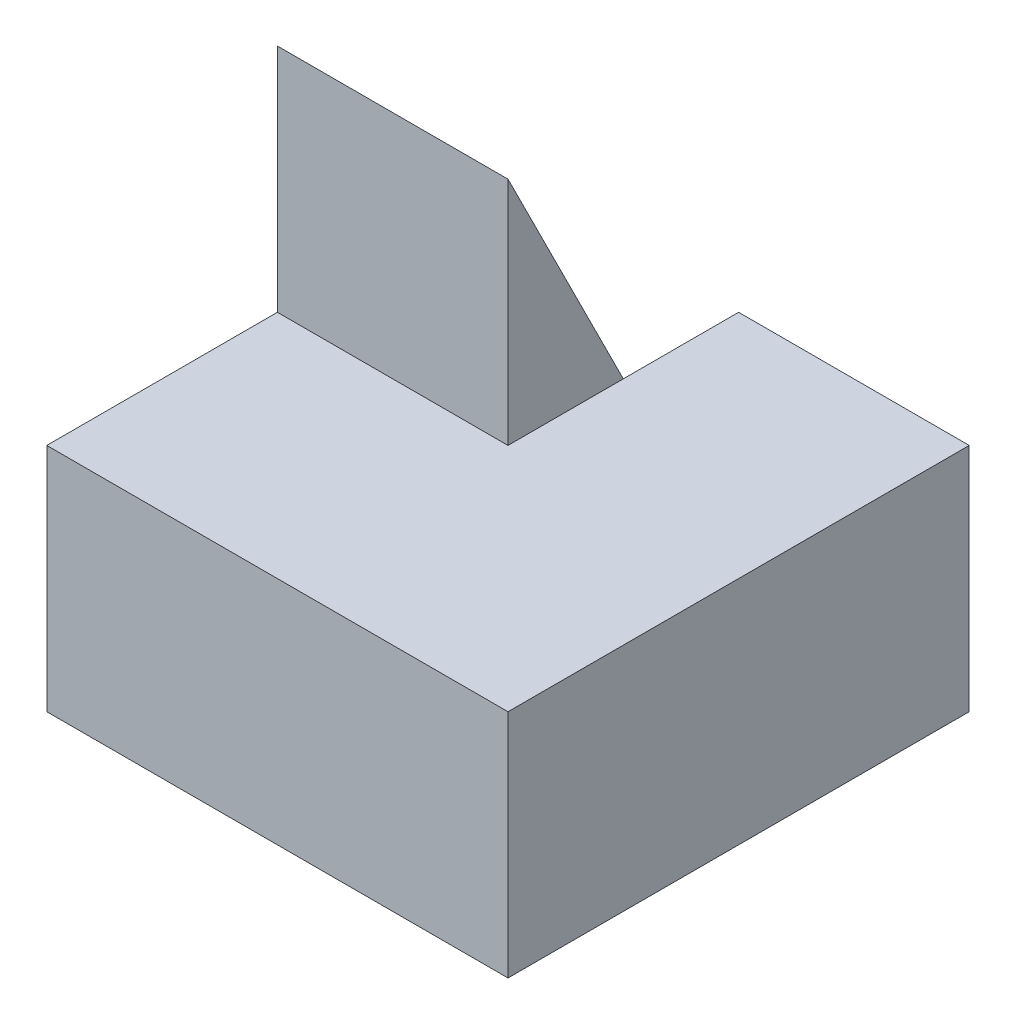
ISO-10303-21;
HEADER;
FILE_DESCRIPTION(('STEP AP214'),'2;1');
FILE_NAME('part.step','',(''),(''),'','','');
FILE_SCHEMA(('AUTOMOTIVE_DESIGN { 1 0 10303 214 1 1 1 1 }'));
ENDSEC;
DATA;
#1=APPLICATION_CONTEXT('core data for automotive mechanical design processes');
#2=APPLICATION_PROTOCOL_DEFINITION('international standard','automotive_design',2000,#1);
#3=PRODUCT_CONTEXT('',#1,'mechanical');
#4=PRODUCT('Part','Part','',(#3));
#5=PRODUCT_RELATED_PRODUCT_CATEGORY('part','',(#4));
#6=PRODUCT_DEFINITION_FORMATION('','',#4);
#7=PRODUCT_DEFINITION_CONTEXT('part definition',#1,'design');
#8=PRODUCT_DEFINITION('design','',#6,#7);
#9=PRODUCT_DEFINITION_SHAPE('','',#8);
#10=(LENGTH_UNIT() NAMED_UNIT(*) SI_UNIT(.MILLI.,.METRE.));
#11=(NAMED_UNIT(*) PLANE_ANGLE_UNIT() SI_UNIT($,.RADIAN.));
#12=(NAMED_UNIT(*) SI_UNIT($,.STERADIAN.) SOLID_ANGLE_UNIT());
#13=UNCERTAINTY_MEASURE_WITH_UNIT(LENGTH_MEASURE(1.E-05),#10,'distance_accuracy_value','');
#14=(GEOMETRIC_REPRESENTATION_CONTEXT(3) GLOBAL_UNCERTAINTY_ASSIGNED_CONTEXT((#13)) GLOBAL_UNIT_ASSIGNED_CONTEXT((#10,
#11,#12)) REPRESENTATION_CONTEXT('',''));
#15=CARTESIAN_POINT('',(0.,0.,0.));
#16=DIRECTION('',(0.,0.,1.));
#17=DIRECTION('',(1.,0.,0.));
#18=AXIS2_PLACEMENT_3D('',#15,#16,#17);
#19=CARTESIAN_POINT('',(0.,4.,-4.));
#20=DIRECTION('',(0.,0.,1.));
#21=DIRECTION('',(1.,0.,0.));
#22=AXIS2_PLACEMENT_3D('',#19,#20,#21);
#23=PLANE('',#22);
#24=DIRECTION('',(0.,-1.,0.));
#25=VECTOR('',#24,1.);
#26=CARTESIAN_POINT('',(2.,0.,-4.));
#27=LINE('',#26,#25);
#28=CARTESIAN_POINT('',(2.,2.,-4.));
#29=VERTEX_POINT('',#28);
#30=CARTESIAN_POINT('',(2.,0.,-4.));
#31=VERTEX_POINT('',#30);
#32=EDGE_CURVE('E91',#29,#31,#27,.T.);
#33=ORIENTED_EDGE('',*,*,#32,.F.);
#34=DIRECTION('',(-1.,0.,0.));
#35=VECTOR('',#34,1.);
#36=CARTESIAN_POINT('',(0.,2.,-4.));
#37=LINE('',#36,#35);
#38=CARTESIAN_POINT('',(4.,2.,-4.));
#39=VERTEX_POINT('',#38);
#40=EDGE_CURVE('E143',#39,#29,#37,.T.);
#41=ORIENTED_EDGE('',*,*,#40,.F.);
#42=DIRECTION('',(0.,-1.,0.));
#43=VECTOR('',#42,1.);
#44=CARTESIAN_POINT('',(4.,4.,-4.));
#45=LINE('',#44,#43);
#46=CARTESIAN_POINT('',(4.,0.,-4.));
#47=VERTEX_POINT('',#46);
#48=EDGE_CURVE('E56',#39,#47,#45,.T.);
#49=ORIENTED_EDGE('',*,*,#48,.T.);
#50=DIRECTION('',(-1.,0.,0.));
#51=VECTOR('',#50,1.);
#52=CARTESIAN_POINT('',(0.,0.,-4.));
#53=LINE('',#52,#51);
#54=EDGE_CURVE('E112',#47,#31,#53,.T.);
#55=ORIENTED_EDGE('',*,*,#54,.T.);
#56=EDGE_LOOP('',(#33,#41,#49,#55));
#57=FACE_BOUND('',#56,.T.);
#58=ADVANCED_FACE('F33',(#57),#23,.F.);
#59=CARTESIAN_POINT('',(0.,4.,0.));
#60=DIRECTION('',(1.,0.,0.));
#61=DIRECTION('',(0.,0.,-1.));
#62=AXIS2_PLACEMENT_3D('',#59,#60,#61);
#63=PLANE('',#62);
#64=DIRECTION('',(0.,1.,0.));
#65=VECTOR('',#64,1.);
#66=CARTESIAN_POINT('',(0.,2.,-2.));
#67=LINE('',#66,#65);
#68=CARTESIAN_POINT('',(0.,2.,-2.));
#69=VERTEX_POINT('',#68);
#70=CARTESIAN_POINT('',(0.,4.,-2.));
#71=VERTEX_POINT('',#70);
#72=EDGE_CURVE('E134',#69,#71,#67,.T.);
#73=ORIENTED_EDGE('',*,*,#72,.T.);
#74=DIRECTION('',(0.,0.894427190999916,0.447213595499958));
#75=VECTOR('',#74,1.);
#76=CARTESIAN_POINT('',(0.,4.,-2.));
#77=LINE('',#76,#75);
#78=CARTESIAN_POINT('',(0.,0.,-4.));
#79=VERTEX_POINT('',#78);
#80=EDGE_CURVE('E97',#79,#71,#77,.T.);
#81=ORIENTED_EDGE('',*,*,#80,.F.);
#82=DIRECTION('',(0.,0.,1.));
#83=VECTOR('',#82,1.);
#84=CARTESIAN_POINT('',(0.,0.,0.));
#85=LINE('',#84,#83);
#86=CARTESIAN_POINT('',(0.,0.,0.));
#87=VERTEX_POINT('',#86);
#88=EDGE_CURVE('E115',#79,#87,#85,.T.);
#89=ORIENTED_EDGE('',*,*,#88,.T.);
#90=DIRECTION('',(0.,-1.,0.));
#91=VECTOR('',#90,1.);
#92=CARTESIAN_POINT('',(0.,4.,0.));
#93=LINE('',#92,#91);
#94=CARTESIAN_POINT('',(0.,2.,0.));
#95=VERTEX_POINT('',#94);
#96=EDGE_CURVE('E11',#95,#87,#93,.T.);
#97=ORIENTED_EDGE('',*,*,#96,.F.);
#98=DIRECTION('',(0.,0.,1.));
#99=VECTOR('',#98,1.);
#100=CARTESIAN_POINT('',(0.,2.,0.));
#101=LINE('',#100,#99);
#102=EDGE_CURVE('E147',#69,#95,#101,.T.);
#103=ORIENTED_EDGE('',*,*,#102,.F.);
#104=EDGE_LOOP('',(#73,#81,#89,#97,#103));
#105=FACE_BOUND('',#104,.T.);
#106=ADVANCED_FACE('F35',(#105),#63,.F.);
#107=CARTESIAN_POINT('',(0.,4.,0.));
#108=DIRECTION('',(0.,0.,-1.));
#109=DIRECTION('',(-1.,0.,0.));
#110=AXIS2_PLACEMENT_3D('',#107,#108,#109);
#111=PLANE('',#110);
#112=DIRECTION('',(1.,0.,0.));
#113=VECTOR('',#112,1.);
#114=CARTESIAN_POINT('',(0.,2.,0.));
#115=LINE('',#114,#113);
#116=CARTESIAN_POINT('',(4.,2.,0.));
#117=VERTEX_POINT('',#116);
#118=EDGE_CURVE('E145',#95,#117,#115,.T.);
#119=ORIENTED_EDGE('',*,*,#118,.F.);
#120=ORIENTED_EDGE('',*,*,#96,.T.);
#121=DIRECTION('',(1.,0.,0.));
#122=VECTOR('',#121,1.);
#123=CARTESIAN_POINT('',(0.,0.,0.));
#124=LINE('',#123,#122);
#125=CARTESIAN_POINT('',(4.,0.,0.));
#126=VERTEX_POINT('',#125);
#127=EDGE_CURVE('E121',#87,#126,#124,.T.);
#128=ORIENTED_EDGE('',*,*,#127,.T.);
#129=DIRECTION('',(0.,-1.,0.));
#130=VECTOR('',#129,1.);
#131=CARTESIAN_POINT('',(4.,4.,0.));
#132=LINE('',#131,#130);
#133=EDGE_CURVE('E41',#117,#126,#132,.T.);
#134=ORIENTED_EDGE('',*,*,#133,.F.);
#135=EDGE_LOOP('',(#119,#120,#128,#134));
#136=FACE_BOUND('',#135,.T.);
#137=ADVANCED_FACE('F132',(#136),#111,.F.);
#138=CARTESIAN_POINT('',(4.,4.,0.));
#139=DIRECTION('',(-1.,0.,0.));
#140=DIRECTION('',(0.,0.,1.));
#141=AXIS2_PLACEMENT_3D('',#138,#139,#140);
#142=PLANE('',#141);
#143=DIRECTION('',(0.,0.,-1.));
#144=VECTOR('',#143,1.);
#145=CARTESIAN_POINT('',(4.,2.,0.));
#146=LINE('',#145,#144);
#147=EDGE_CURVE('E129',#117,#39,#146,.T.);
#148=ORIENTED_EDGE('',*,*,#147,.F.);
#149=ORIENTED_EDGE('',*,*,#133,.T.);
#150=DIRECTION('',(0.,0.,-1.));
#151=VECTOR('',#150,1.);
#152=CARTESIAN_POINT('',(4.,0.,0.));
#153=LINE('',#152,#151);
#154=EDGE_CURVE('E118',#126,#47,#153,.T.);
#155=ORIENTED_EDGE('',*,*,#154,.T.);
#156=ORIENTED_EDGE('',*,*,#48,.F.);
#157=EDGE_LOOP('',(#148,#149,#155,#156));
#158=FACE_BOUND('',#157,.T.);
#159=ADVANCED_FACE('F128',(#158),#142,.F.);
#160=CARTESIAN_POINT('',(0.,0.,0.));
#161=DIRECTION('',(0.,-1.,0.));
#162=DIRECTION('',(0.,0.,-1.));
#163=AXIS2_PLACEMENT_3D('',#160,#161,#162);
#164=PLANE('',#163);
#165=ORIENTED_EDGE('',*,*,#88,.F.);
#166=DIRECTION('',(-1.,0.,0.));
#167=VECTOR('',#166,1.);
#168=CARTESIAN_POINT('',(2.,0.,-4.));
#169=LINE('',#168,#167);
#170=EDGE_CURVE('E102',#31,#79,#169,.T.);
#171=ORIENTED_EDGE('',*,*,#170,.F.);
#172=ORIENTED_EDGE('',*,*,#54,.F.);
#173=ORIENTED_EDGE('',*,*,#154,.F.);
#174=ORIENTED_EDGE('',*,*,#127,.F.);
#175=EDGE_LOOP('',(#165,#171,#172,#173,#174));
#176=FACE_BOUND('',#175,.T.);
#177=ADVANCED_FACE('F110',(#176),#164,.T.);
#178=CARTESIAN_POINT('',(0.,2.,-2.));
#179=DIRECTION('',(0.,0.,1.));
#180=DIRECTION('',(1.,0.,0.));
#181=AXIS2_PLACEMENT_3D('',#178,#179,#180);
#182=PLANE('',#181);
#183=DIRECTION('',(1.,0.,0.));
#184=VECTOR('',#183,1.);
#185=CARTESIAN_POINT('',(0.,4.,-2.));
#186=LINE('',#185,#184);
#187=CARTESIAN_POINT('',(2.,4.,-2.));
#188=VERTEX_POINT('',#187);
#189=EDGE_CURVE('E116',#71,#188,#186,.T.);
#190=ORIENTED_EDGE('',*,*,#189,.F.);
#191=ORIENTED_EDGE('',*,*,#72,.F.);
#192=DIRECTION('',(1.,0.,0.));
#193=VECTOR('',#192,1.);
#194=CARTESIAN_POINT('',(0.,2.,-2.));
#195=LINE('',#194,#193);
#196=CARTESIAN_POINT('',(2.,2.,-2.));
#197=VERTEX_POINT('',#196);
#198=EDGE_CURVE('E149',#69,#197,#195,.T.);
#199=ORIENTED_EDGE('',*,*,#198,.T.);
#200=DIRECTION('',(0.,1.,0.));
#201=VECTOR('',#200,1.);
#202=CARTESIAN_POINT('',(2.,2.,-2.));
#203=LINE('',#202,#201);
#204=EDGE_CURVE('E137',#197,#188,#203,.T.);
#205=ORIENTED_EDGE('',*,*,#204,.T.);
#206=EDGE_LOOP('',(#190,#191,#199,#205));
#207=FACE_BOUND('',#206,.T.);
#208=ADVANCED_FACE('F158',(#207),#182,.T.);
#209=CARTESIAN_POINT('',(2.,2.,0.));
#210=DIRECTION('',(-1.,0.,0.));
#211=DIRECTION('',(0.,0.,1.));
#212=AXIS2_PLACEMENT_3D('',#209,#210,#211);
#213=PLANE('',#212);
#214=DIRECTION('',(0.,0.,1.));
#215=VECTOR('',#214,1.);
#216=CARTESIAN_POINT('',(2.,2.,0.));
#217=LINE('',#216,#215);
#218=CARTESIAN_POINT('',(2.,2.,-3.));
#219=VERTEX_POINT('',#218);
#220=EDGE_CURVE('E153',#219,#197,#217,.T.);
#221=ORIENTED_EDGE('',*,*,#220,.F.);
#222=DIRECTION('',(0.,0.894427190999916,0.447213595499958));
#223=VECTOR('',#222,1.);
#224=CARTESIAN_POINT('',(2.,4.,-2.));
#225=LINE('',#224,#223);
#226=EDGE_CURVE('E96',#219,#188,#225,.T.);
#227=ORIENTED_EDGE('',*,*,#226,.T.);
#228=ORIENTED_EDGE('',*,*,#204,.F.);
#229=EDGE_LOOP('',(#221,#227,#228));
#230=FACE_BOUND('',#229,.T.);
#231=ADVANCED_FACE('F165',(#230),#213,.F.);
#232=CARTESIAN_POINT('',(0.,2.,0.));
#233=DIRECTION('',(0.,1.,0.));
#234=DIRECTION('',(0.,0.,1.));
#235=AXIS2_PLACEMENT_3D('',#232,#233,#234);
#236=PLANE('',#235);
#237=ORIENTED_EDGE('',*,*,#40,.T.);
#238=EDGE_CURVE('E94',#29,#219,#217,.T.);
#239=ORIENTED_EDGE('',*,*,#238,.T.);
#240=ORIENTED_EDGE('',*,*,#220,.T.);
#241=ORIENTED_EDGE('',*,*,#198,.F.);
#242=ORIENTED_EDGE('',*,*,#102,.T.);
#243=ORIENTED_EDGE('',*,*,#118,.T.);
#244=ORIENTED_EDGE('',*,*,#147,.T.);
#245=EDGE_LOOP('',(#237,#239,#240,#241,#242,#243,#244));
#246=FACE_BOUND('',#245,.T.);
#247=ADVANCED_FACE('F163',(#246),#236,.T.);
#248=CARTESIAN_POINT('',(2.,4.,-2.));
#249=DIRECTION('',(0.,-0.447213595499958,0.894427190999916));
#250=DIRECTION('',(0.,-0.894427190999916,-0.447213595499958));
#251=AXIS2_PLACEMENT_3D('',#248,#249,#250);
#252=PLANE('',#251);
#253=ORIENTED_EDGE('',*,*,#80,.T.);
#254=ORIENTED_EDGE('',*,*,#189,.T.);
#255=ORIENTED_EDGE('',*,*,#226,.F.);
#256=EDGE_CURVE('E48',#31,#219,#225,.T.);
#257=ORIENTED_EDGE('',*,*,#256,.F.);
#258=ORIENTED_EDGE('',*,*,#170,.T.);
#259=EDGE_LOOP('',(#253,#254,#255,#257,#258));
#260=FACE_BOUND('',#259,.T.);
#261=ADVANCED_FACE('F101',(#260),#252,.F.);
#262=CARTESIAN_POINT('',(2.,0.,0.));
#263=DIRECTION('',(-1.,0.,0.));
#264=DIRECTION('',(0.,0.,1.));
#265=AXIS2_PLACEMENT_3D('',#262,#263,#264);
#266=PLANE('',#265);
#267=ORIENTED_EDGE('',*,*,#32,.T.);
#268=ORIENTED_EDGE('',*,*,#256,.T.);
#269=ORIENTED_EDGE('',*,*,#238,.F.);
#270=EDGE_LOOP('',(#267,#268,#269));
#271=FACE_BOUND('',#270,.T.);
#272=ADVANCED_FACE('F92',(#271),#266,.T.);
#273=CLOSED_SHELL('',(#58,#106,#137,#159,#177,#208,#231,#247,#261,#272));
#274=MANIFOLD_SOLID_BREP('B2',#273);
#275=ADVANCED_BREP_SHAPE_REPRESENTATION('',(#18,#274),#14);
#276=SHAPE_DEFINITION_REPRESENTATION(#9,#275);
ENDSEC;
END-ISO-10303-21;
